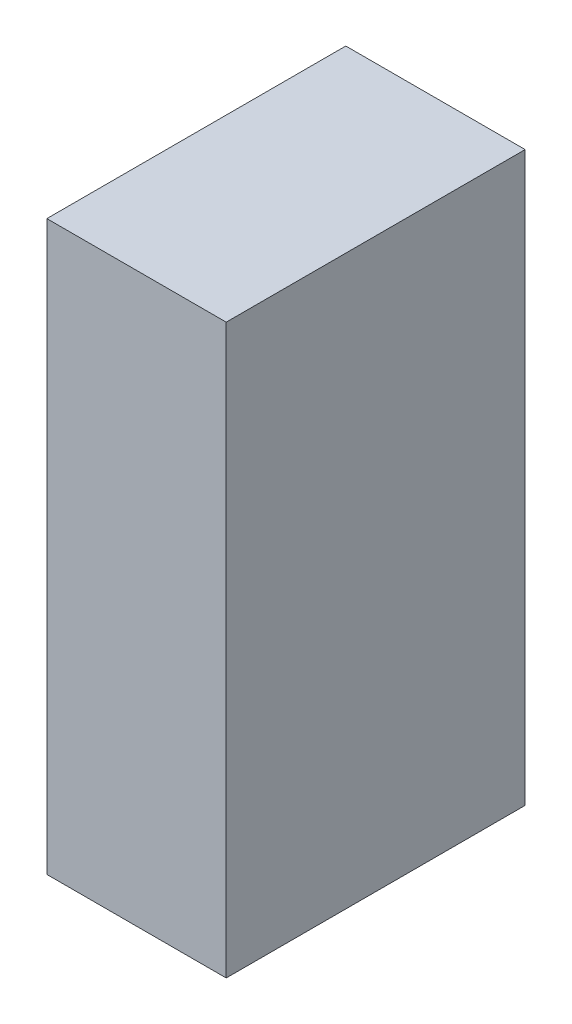
ISO-10303-21;
HEADER;
FILE_DESCRIPTION(('STEP AP214'),'2;1');
FILE_NAME('part.step','',(''),(''),'','','');
FILE_SCHEMA(('AUTOMOTIVE_DESIGN { 1 0 10303 214 1 1 1 1 }'));
ENDSEC;
DATA;
#1=APPLICATION_CONTEXT('core data for automotive mechanical design processes');
#2=APPLICATION_PROTOCOL_DEFINITION('international standard','automotive_design',2000,#1);
#3=PRODUCT_CONTEXT('',#1,'mechanical');
#4=PRODUCT('Part','Part','',(#3));
#5=PRODUCT_RELATED_PRODUCT_CATEGORY('part','',(#4));
#6=PRODUCT_DEFINITION_FORMATION('','',#4);
#7=PRODUCT_DEFINITION_CONTEXT('part definition',#1,'design');
#8=PRODUCT_DEFINITION('design','',#6,#7);
#9=PRODUCT_DEFINITION_SHAPE('','',#8);
#10=(LENGTH_UNIT() NAMED_UNIT(*) SI_UNIT(.MILLI.,.METRE.));
#11=(NAMED_UNIT(*) PLANE_ANGLE_UNIT() SI_UNIT($,.RADIAN.));
#12=(NAMED_UNIT(*) SI_UNIT($,.STERADIAN.) SOLID_ANGLE_UNIT());
#13=UNCERTAINTY_MEASURE_WITH_UNIT(LENGTH_MEASURE(1.E-05),#10,'distance_accuracy_value','');
#14=(GEOMETRIC_REPRESENTATION_CONTEXT(3) GLOBAL_UNCERTAINTY_ASSIGNED_CONTEXT((#13)) GLOBAL_UNIT_ASSIGNED_CONTEXT((#10,
#11,#12)) REPRESENTATION_CONTEXT('',''));
#15=CARTESIAN_POINT('',(0.,0.,0.));
#16=DIRECTION('',(0.,0.,1.));
#17=DIRECTION('',(1.,0.,0.));
#18=AXIS2_PLACEMENT_3D('',#15,#16,#17);
#19=CARTESIAN_POINT('',(-0.1499997,0.47500032,0.));
#20=DIRECTION('',(1.,0.,0.));
#21=DIRECTION('',(0.,0.,-1.));
#22=AXIS2_PLACEMENT_3D('',#19,#20,#21);
#23=PLANE('',#22);
#24=DIRECTION('',(0.,0.,1.));
#25=VECTOR('',#24,1.);
#26=CARTESIAN_POINT('',(-0.1499997,-0.47500032,0.));
#27=LINE('',#26,#25);
#28=CARTESIAN_POINT('',(-0.1499997,-0.47500032,0.));
#29=VERTEX_POINT('',#28);
#30=CARTESIAN_POINT('',(-0.1499997,-0.47500032,0.499999));
#31=VERTEX_POINT('',#30);
#32=EDGE_CURVE('E19',#29,#31,#27,.T.);
#33=ORIENTED_EDGE('',*,*,#32,.T.);
#34=DIRECTION('',(0.,1.,0.));
#35=VECTOR('',#34,1.);
#36=CARTESIAN_POINT('',(-0.1499997,-0.47500032,0.499999));
#37=LINE('',#36,#35);
#38=CARTESIAN_POINT('',(-0.1499997,0.47500032,0.499999));
#39=VERTEX_POINT('',#38);
#40=EDGE_CURVE('E54',#31,#39,#37,.T.);
#41=ORIENTED_EDGE('',*,*,#40,.T.);
#42=DIRECTION('',(0.,0.,-1.));
#43=VECTOR('',#42,1.);
#44=CARTESIAN_POINT('',(-0.1499997,0.47500032,0.));
#45=LINE('',#44,#43);
#46=CARTESIAN_POINT('',(-0.1499997,0.47500032,0.));
#47=VERTEX_POINT('',#46);
#48=EDGE_CURVE('E75',#39,#47,#45,.T.);
#49=ORIENTED_EDGE('',*,*,#48,.T.);
#50=DIRECTION('',(0.,1.,0.));
#51=VECTOR('',#50,1.);
#52=CARTESIAN_POINT('',(-0.1499997,-0.47500032,0.));
#53=LINE('',#52,#51);
#54=EDGE_CURVE('E57',#29,#47,#53,.T.);
#55=ORIENTED_EDGE('',*,*,#54,.F.);
#56=EDGE_LOOP('',(#33,#41,#49,#55));
#57=FACE_BOUND('',#56,.T.);
#58=ADVANCED_FACE('F16',(#57),#23,.F.);
#59=CARTESIAN_POINT('',(-0.1499997,-0.47500032,0.));
#60=DIRECTION('',(0.,1.,0.));
#61=DIRECTION('',(0.,0.,1.));
#62=AXIS2_PLACEMENT_3D('',#59,#60,#61);
#63=PLANE('',#62);
#64=DIRECTION('',(0.,0.,1.));
#65=VECTOR('',#64,1.);
#66=CARTESIAN_POINT('',(0.1499997,-0.47500032,0.));
#67=LINE('',#66,#65);
#68=CARTESIAN_POINT('',(0.1499997,-0.47500032,0.));
#69=VERTEX_POINT('',#68);
#70=CARTESIAN_POINT('',(0.1499997,-0.47500032,0.499999));
#71=VERTEX_POINT('',#70);
#72=EDGE_CURVE('E72',#69,#71,#67,.T.);
#73=ORIENTED_EDGE('',*,*,#72,.T.);
#74=DIRECTION('',(-1.,0.,0.));
#75=VECTOR('',#74,1.);
#76=CARTESIAN_POINT('',(0.1499997,-0.47500032,0.499999));
#77=LINE('',#76,#75);
#78=EDGE_CURVE('E62',#71,#31,#77,.T.);
#79=ORIENTED_EDGE('',*,*,#78,.T.);
#80=ORIENTED_EDGE('',*,*,#32,.F.);
#81=DIRECTION('',(-1.,0.,0.));
#82=VECTOR('',#81,1.);
#83=CARTESIAN_POINT('',(0.1499997,-0.47500032,0.));
#84=LINE('',#83,#82);
#85=EDGE_CURVE('E77',#69,#29,#84,.T.);
#86=ORIENTED_EDGE('',*,*,#85,.F.);
#87=EDGE_LOOP('',(#73,#79,#80,#86));
#88=FACE_BOUND('',#87,.T.);
#89=ADVANCED_FACE('F71',(#88),#63,.F.);
#90=CARTESIAN_POINT('',(0.1499997,-0.47500032,0.499999));
#91=DIRECTION('',(0.,0.,-1.));
#92=DIRECTION('',(-1.,0.,0.));
#93=AXIS2_PLACEMENT_3D('',#90,#91,#92);
#94=PLANE('',#93);
#95=DIRECTION('',(1.,0.,0.));
#96=VECTOR('',#95,1.);
#97=CARTESIAN_POINT('',(0.1499997,0.47500032,0.499999));
#98=LINE('',#97,#96);
#99=CARTESIAN_POINT('',(0.1499997,0.47500032,0.499999));
#100=VERTEX_POINT('',#99);
#101=EDGE_CURVE('E68',#100,#39,#98,.F.);
#102=ORIENTED_EDGE('',*,*,#101,.T.);
#103=ORIENTED_EDGE('',*,*,#40,.F.);
#104=ORIENTED_EDGE('',*,*,#78,.F.);
#105=DIRECTION('',(0.,1.,0.));
#106=VECTOR('',#105,1.);
#107=CARTESIAN_POINT('',(0.1499997,-0.47500032,0.499999));
#108=LINE('',#107,#106);
#109=EDGE_CURVE('E82',#71,#100,#108,.T.);
#110=ORIENTED_EDGE('',*,*,#109,.T.);
#111=EDGE_LOOP('',(#102,#103,#104,#110));
#112=FACE_BOUND('',#111,.T.);
#113=ADVANCED_FACE('F65',(#112),#94,.F.);
#114=CARTESIAN_POINT('',(0.1499997,0.47500032,0.));
#115=DIRECTION('',(0.,-1.,0.));
#116=DIRECTION('',(0.,0.,-1.));
#117=AXIS2_PLACEMENT_3D('',#114,#115,#116);
#118=PLANE('',#117);
#119=ORIENTED_EDGE('',*,*,#48,.F.);
#120=ORIENTED_EDGE('',*,*,#101,.F.);
#121=DIRECTION('',(0.,0.,1.));
#122=VECTOR('',#121,1.);
#123=CARTESIAN_POINT('',(0.1499997,0.47500032,0.));
#124=LINE('',#123,#122);
#125=CARTESIAN_POINT('',(0.1499997,0.47500032,0.));
#126=VERTEX_POINT('',#125);
#127=EDGE_CURVE('E25',#100,#126,#124,.F.);
#128=ORIENTED_EDGE('',*,*,#127,.T.);
#129=DIRECTION('',(-1.,0.,0.));
#130=VECTOR('',#129,1.);
#131=CARTESIAN_POINT('',(0.1499997,0.47500032,0.));
#132=LINE('',#131,#130);
#133=EDGE_CURVE('E33',#47,#126,#132,.F.);
#134=ORIENTED_EDGE('',*,*,#133,.F.);
#135=EDGE_LOOP('',(#119,#120,#128,#134));
#136=FACE_BOUND('',#135,.T.);
#137=ADVANCED_FACE('F87',(#136),#118,.F.);
#138=CARTESIAN_POINT('',(0.1499997,-0.47500032,0.));
#139=DIRECTION('',(0.,0.,-1.));
#140=DIRECTION('',(-1.,0.,0.));
#141=AXIS2_PLACEMENT_3D('',#138,#139,#140);
#142=PLANE('',#141);
#143=ORIENTED_EDGE('',*,*,#133,.T.);
#144=DIRECTION('',(0.,1.,0.));
#145=VECTOR('',#144,1.);
#146=CARTESIAN_POINT('',(0.1499997,-0.47500032,0.));
#147=LINE('',#146,#145);
#148=EDGE_CURVE('E11',#126,#69,#147,.F.);
#149=ORIENTED_EDGE('',*,*,#148,.T.);
#150=ORIENTED_EDGE('',*,*,#85,.T.);
#151=ORIENTED_EDGE('',*,*,#54,.T.);
#152=EDGE_LOOP('',(#143,#149,#150,#151));
#153=FACE_BOUND('',#152,.T.);
#154=ADVANCED_FACE('F90',(#153),#142,.T.);
#155=CARTESIAN_POINT('',(0.1499997,-0.47500032,0.));
#156=DIRECTION('',(-1.,0.,0.));
#157=DIRECTION('',(0.,0.,1.));
#158=AXIS2_PLACEMENT_3D('',#155,#156,#157);
#159=PLANE('',#158);
#160=ORIENTED_EDGE('',*,*,#127,.F.);
#161=ORIENTED_EDGE('',*,*,#109,.F.);
#162=ORIENTED_EDGE('',*,*,#72,.F.);
#163=ORIENTED_EDGE('',*,*,#148,.F.);
#164=EDGE_LOOP('',(#160,#161,#162,#163));
#165=FACE_BOUND('',#164,.T.);
#166=ADVANCED_FACE('F89',(#165),#159,.F.);
#167=CLOSED_SHELL('',(#58,#89,#113,#137,#154,#166));
#168=MANIFOLD_SOLID_BREP('B1',#167);
#169=ADVANCED_BREP_SHAPE_REPRESENTATION('',(#18,#168),#14);
#170=SHAPE_DEFINITION_REPRESENTATION(#9,#169);
ENDSEC;
END-ISO-10303-21;
